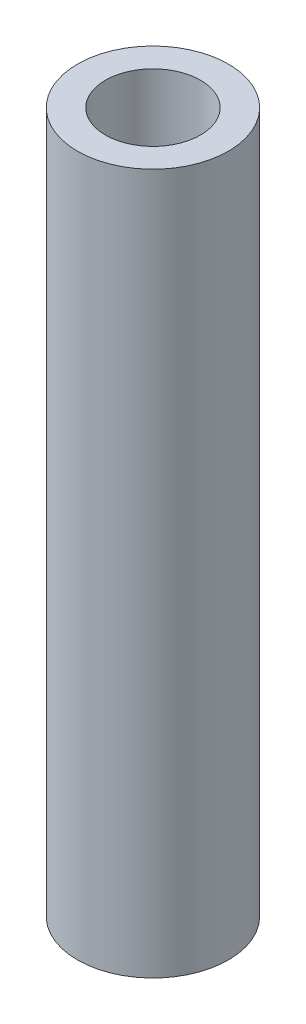
ISO-10303-21;
HEADER;
FILE_DESCRIPTION(('STEP AP214'),'2;1');
FILE_NAME('part.step','',(''),(''),'','','');
FILE_SCHEMA(('AUTOMOTIVE_DESIGN { 1 0 10303 214 1 1 1 1 }'));
ENDSEC;
DATA;
#1=APPLICATION_CONTEXT('core data for automotive mechanical design processes');
#2=APPLICATION_PROTOCOL_DEFINITION('international standard','automotive_design',2000,#1);
#3=PRODUCT_CONTEXT('',#1,'mechanical');
#4=PRODUCT('Part','Part','',(#3));
#5=PRODUCT_RELATED_PRODUCT_CATEGORY('part','',(#4));
#6=PRODUCT_DEFINITION_FORMATION('','',#4);
#7=PRODUCT_DEFINITION_CONTEXT('part definition',#1,'design');
#8=PRODUCT_DEFINITION('design','',#6,#7);
#9=PRODUCT_DEFINITION_SHAPE('','',#8);
#10=(LENGTH_UNIT() NAMED_UNIT(*) SI_UNIT(.MILLI.,.METRE.));
#11=(NAMED_UNIT(*) PLANE_ANGLE_UNIT() SI_UNIT($,.RADIAN.));
#12=(NAMED_UNIT(*) SI_UNIT($,.STERADIAN.) SOLID_ANGLE_UNIT());
#13=UNCERTAINTY_MEASURE_WITH_UNIT(LENGTH_MEASURE(1.E-05),#10,'distance_accuracy_value','');
#14=(GEOMETRIC_REPRESENTATION_CONTEXT(3) GLOBAL_UNCERTAINTY_ASSIGNED_CONTEXT((#13)) GLOBAL_UNIT_ASSIGNED_CONTEXT((#10,
#11,#12)) REPRESENTATION_CONTEXT('',''));
#15=CARTESIAN_POINT('',(0.,0.,0.));
#16=DIRECTION('',(0.,0.,1.));
#17=DIRECTION('',(1.,0.,0.));
#18=AXIS2_PLACEMENT_3D('',#15,#16,#17);
#19=CARTESIAN_POINT('',(0.,-29.464,0.));
#20=DIRECTION('',(0.,1.,0.));
#21=DIRECTION('',(0.,0.,1.));
#22=AXIS2_PLACEMENT_3D('',#19,#20,#21);
#23=CYLINDRICAL_SURFACE('',#22,3.175);
#24=CARTESIAN_POINT('',(0.,-29.464,0.));
#25=DIRECTION('',(0.,1.,0.));
#26=DIRECTION('',(0.,0.,1.));
#27=AXIS2_PLACEMENT_3D('',#24,#25,#26);
#28=CIRCLE('',#27,3.175);
#29=CARTESIAN_POINT('',(0.,-29.464,3.175));
#30=VERTEX_POINT('',#29);
#31=EDGE_CURVE('E10',#30,#30,#28,.T.);
#32=ORIENTED_EDGE('',*,*,#31,.T.);
#33=EDGE_LOOP('',(#32));
#34=FACE_BOUND('',#33,.T.);
#35=CARTESIAN_POINT('',(0.,0.,0.));
#36=DIRECTION('',(0.,1.,0.));
#37=DIRECTION('',(0.,0.,1.));
#38=AXIS2_PLACEMENT_3D('',#35,#36,#37);
#39=CIRCLE('',#38,3.175);
#40=CARTESIAN_POINT('',(0.,0.,3.175));
#41=VERTEX_POINT('',#40);
#42=EDGE_CURVE('E40',#41,#41,#39,.T.);
#43=ORIENTED_EDGE('',*,*,#42,.F.);
#44=EDGE_LOOP('',(#43));
#45=FACE_BOUND('',#44,.T.);
#46=ADVANCED_FACE('F37',(#34,#45),#23,.T.);
#47=CARTESIAN_POINT('',(0.,-29.464,0.));
#48=DIRECTION('',(0.,1.,0.));
#49=DIRECTION('',(0.,0.,1.));
#50=AXIS2_PLACEMENT_3D('',#47,#48,#49);
#51=PLANE('',#50);
#52=CARTESIAN_POINT('',(0.,-29.464,0.));
#53=DIRECTION('',(0.,1.,0.));
#54=DIRECTION('',(0.,0.,1.));
#55=AXIS2_PLACEMENT_3D('',#52,#53,#54);
#56=CIRCLE('',#55,2.);
#57=CARTESIAN_POINT('',(0.,-29.464,2.));
#58=VERTEX_POINT('',#57);
#59=EDGE_CURVE('E49',#58,#58,#56,.T.);
#60=ORIENTED_EDGE('',*,*,#59,.T.);
#61=EDGE_LOOP('',(#60));
#62=FACE_BOUND('',#61,.T.);
#63=ORIENTED_EDGE('',*,*,#31,.F.);
#64=EDGE_LOOP('',(#63));
#65=FACE_BOUND('',#64,.T.);
#66=ADVANCED_FACE('F59',(#62,#65),#51,.F.);
#67=CARTESIAN_POINT('',(0.,0.,0.));
#68=DIRECTION('',(0.,1.,0.));
#69=DIRECTION('',(0.,0.,1.));
#70=AXIS2_PLACEMENT_3D('',#67,#68,#69);
#71=PLANE('',#70);
#72=CARTESIAN_POINT('',(0.,0.,0.));
#73=DIRECTION('',(0.,1.,0.));
#74=DIRECTION('',(0.,0.,1.));
#75=AXIS2_PLACEMENT_3D('',#72,#73,#74);
#76=CIRCLE('',#75,2.);
#77=CARTESIAN_POINT('',(0.,0.,2.));
#78=VERTEX_POINT('',#77);
#79=EDGE_CURVE('E51',#78,#78,#76,.T.);
#80=ORIENTED_EDGE('',*,*,#79,.F.);
#81=EDGE_LOOP('',(#80));
#82=FACE_BOUND('',#81,.T.);
#83=ORIENTED_EDGE('',*,*,#42,.T.);
#84=EDGE_LOOP('',(#83));
#85=FACE_BOUND('',#84,.T.);
#86=ADVANCED_FACE('F65',(#82,#85),#71,.T.);
#87=CARTESIAN_POINT('',(0.,-29.464,0.));
#88=DIRECTION('',(0.,1.,0.));
#89=DIRECTION('',(0.,0.,1.));
#90=AXIS2_PLACEMENT_3D('',#87,#88,#89);
#91=CYLINDRICAL_SURFACE('',#90,2.);
#92=ORIENTED_EDGE('',*,*,#59,.F.);
#93=EDGE_LOOP('',(#92));
#94=FACE_BOUND('',#93,.T.);
#95=ORIENTED_EDGE('',*,*,#79,.T.);
#96=EDGE_LOOP('',(#95));
#97=FACE_BOUND('',#96,.T.);
#98=ADVANCED_FACE('F62',(#94,#97),#91,.F.);
#99=CLOSED_SHELL('',(#46,#66,#86,#98));
#100=MANIFOLD_SOLID_BREP('B2',#99);
#101=ADVANCED_BREP_SHAPE_REPRESENTATION('',(#18,#100),#14);
#102=SHAPE_DEFINITION_REPRESENTATION(#9,#101);
ENDSEC;
END-ISO-10303-21;
